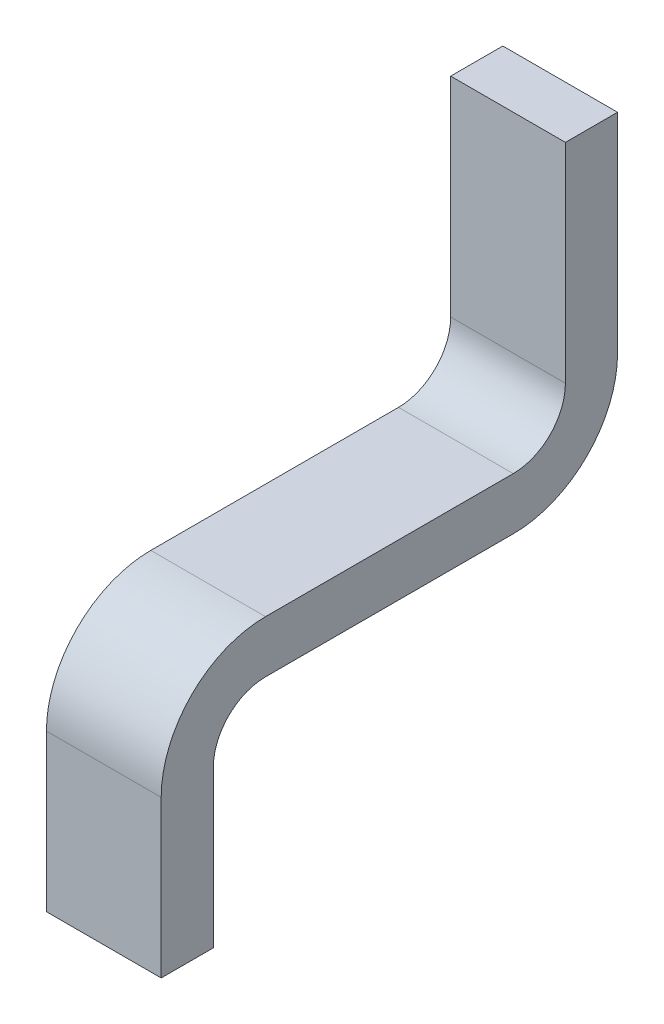
ISO-10303-21;
HEADER;
FILE_DESCRIPTION(('STEP AP214'),'2;1');
FILE_NAME('part.step','',(''),(''),'','','');
FILE_SCHEMA(('AUTOMOTIVE_DESIGN { 1 0 10303 214 1 1 1 1 }'));
ENDSEC;
DATA;
#1=APPLICATION_CONTEXT('core data for automotive mechanical design processes');
#2=APPLICATION_PROTOCOL_DEFINITION('international standard','automotive_design',2000,#1);
#3=PRODUCT_CONTEXT('',#1,'mechanical');
#4=PRODUCT('Part','Part','',(#3));
#5=PRODUCT_RELATED_PRODUCT_CATEGORY('part','',(#4));
#6=PRODUCT_DEFINITION_FORMATION('','',#4);
#7=PRODUCT_DEFINITION_CONTEXT('part definition',#1,'design');
#8=PRODUCT_DEFINITION('design','',#6,#7);
#9=PRODUCT_DEFINITION_SHAPE('','',#8);
#10=(LENGTH_UNIT() NAMED_UNIT(*) SI_UNIT(.MILLI.,.METRE.));
#11=(NAMED_UNIT(*) PLANE_ANGLE_UNIT() SI_UNIT($,.RADIAN.));
#12=(NAMED_UNIT(*) SI_UNIT($,.STERADIAN.) SOLID_ANGLE_UNIT());
#13=UNCERTAINTY_MEASURE_WITH_UNIT(LENGTH_MEASURE(1.E-05),#10,'distance_accuracy_value','');
#14=(GEOMETRIC_REPRESENTATION_CONTEXT(3) GLOBAL_UNCERTAINTY_ASSIGNED_CONTEXT((#13)) GLOBAL_UNIT_ASSIGNED_CONTEXT((#10,
#11,#12)) REPRESENTATION_CONTEXT('',''));
#15=CARTESIAN_POINT('',(0.,0.,0.));
#16=DIRECTION('',(0.,0.,1.));
#17=DIRECTION('',(1.,0.,0.));
#18=AXIS2_PLACEMENT_3D('',#15,#16,#17);
#19=CARTESIAN_POINT('',(-0.36,3.9,0.675));
#20=DIRECTION('',(1.,0.,0.));
#21=DIRECTION('',(0.,1.,0.));
#22=AXIS2_PLACEMENT_3D('',#19,#20,#21);
#23=PLANE('',#22);
#24=CARTESIAN_POINT('',(-0.36,3.8,0.675));
#25=DIRECTION('',(1.,0.,0.));
#26=DIRECTION('',(0.,1.,0.));
#27=AXIS2_PLACEMENT_3D('',#24,#25,#26);
#28=CIRCLE('',#27,0.1);
#29=CARTESIAN_POINT('',(-0.36,3.9,0.675));
#30=VERTEX_POINT('',#29);
#31=CARTESIAN_POINT('',(-0.36,3.8,0.775));
#32=VERTEX_POINT('',#31);
#33=EDGE_CURVE('E162',#30,#32,#28,.T.);
#34=ORIENTED_EDGE('',*,*,#33,.T.);
#35=DIRECTION('',(0.,1.,0.));
#36=VECTOR('',#35,1.);
#37=CARTESIAN_POINT('',(-0.36,3.5,0.775));
#38=LINE('',#37,#36);
#39=CARTESIAN_POINT('',(-0.36,3.5,0.775));
#40=VERTEX_POINT('',#39);
#41=EDGE_CURVE('E120',#32,#40,#38,.F.);
#42=ORIENTED_EDGE('',*,*,#41,.T.);
#43=DIRECTION('',(0.,0.,1.));
#44=VECTOR('',#43,1.);
#45=CARTESIAN_POINT('',(-0.36,3.5,0.775));
#46=LINE('',#45,#44);
#47=CARTESIAN_POINT('',(-0.36,3.5,0.875));
#48=VERTEX_POINT('',#47);
#49=EDGE_CURVE('E116',#48,#40,#46,.F.);
#50=ORIENTED_EDGE('',*,*,#49,.F.);
#51=DIRECTION('',(0.,1.,0.));
#52=VECTOR('',#51,1.);
#53=CARTESIAN_POINT('',(-0.36,3.5,0.875));
#54=LINE('',#53,#52);
#55=CARTESIAN_POINT('',(-0.36,3.8,0.875));
#56=VERTEX_POINT('',#55);
#57=EDGE_CURVE('E111',#48,#56,#54,.T.);
#58=ORIENTED_EDGE('',*,*,#57,.T.);
#59=CARTESIAN_POINT('',(-0.36,3.8,0.675));
#60=DIRECTION('',(1.,0.,0.));
#61=DIRECTION('',(0.,1.,0.));
#62=AXIS2_PLACEMENT_3D('',#59,#60,#61);
#63=CIRCLE('',#62,0.2);
#64=CARTESIAN_POINT('',(-0.36,4.,0.675));
#65=VERTEX_POINT('',#64);
#66=EDGE_CURVE('E102',#65,#56,#63,.T.);
#67=ORIENTED_EDGE('',*,*,#66,.F.);
#68=DIRECTION('',(0.,0.,1.));
#69=VECTOR('',#68,1.);
#70=CARTESIAN_POINT('',(-0.36,4.,0.675));
#71=LINE('',#70,#69);
#72=CARTESIAN_POINT('',(-0.36,4.,0.2));
#73=VERTEX_POINT('',#72);
#74=EDGE_CURVE('E98',#65,#73,#71,.F.);
#75=ORIENTED_EDGE('',*,*,#74,.T.);
#76=CARTESIAN_POINT('',(-0.36,4.1,0.2));
#77=DIRECTION('',(-1.,0.,0.));
#78=DIRECTION('',(0.,-1.,0.));
#79=AXIS2_PLACEMENT_3D('',#76,#77,#78);
#80=CIRCLE('',#79,0.1);
#81=CARTESIAN_POINT('',(-0.36,4.1,0.1));
#82=VERTEX_POINT('',#81);
#83=EDGE_CURVE('E20',#73,#82,#80,.F.);
#84=ORIENTED_EDGE('',*,*,#83,.T.);
#85=DIRECTION('',(0.,1.,0.));
#86=VECTOR('',#85,1.);
#87=CARTESIAN_POINT('',(-0.36,4.1,0.1));
#88=LINE('',#87,#86);
#89=CARTESIAN_POINT('',(-0.36,4.5,0.1));
#90=VERTEX_POINT('',#89);
#91=EDGE_CURVE('E145',#82,#90,#88,.T.);
#92=ORIENTED_EDGE('',*,*,#91,.T.);
#93=DIRECTION('',(0.,0.,1.));
#94=VECTOR('',#93,1.);
#95=CARTESIAN_POINT('',(-0.36,4.5,0.));
#96=LINE('',#95,#94);
#97=CARTESIAN_POINT('',(-0.36,4.5,0.));
#98=VERTEX_POINT('',#97);
#99=EDGE_CURVE('E139',#90,#98,#96,.F.);
#100=ORIENTED_EDGE('',*,*,#99,.T.);
#101=DIRECTION('',(0.,1.,0.));
#102=VECTOR('',#101,1.);
#103=CARTESIAN_POINT('',(-0.36,4.1,0.));
#104=LINE('',#103,#102);
#105=CARTESIAN_POINT('',(-0.36,4.1,0.));
#106=VERTEX_POINT('',#105);
#107=EDGE_CURVE('E132',#98,#106,#104,.F.);
#108=ORIENTED_EDGE('',*,*,#107,.T.);
#109=CARTESIAN_POINT('',(-0.36,4.1,0.2));
#110=DIRECTION('',(-1.,0.,0.));
#111=DIRECTION('',(0.,-1.,0.));
#112=AXIS2_PLACEMENT_3D('',#109,#110,#111);
#113=CIRCLE('',#112,0.2);
#114=CARTESIAN_POINT('',(-0.36,3.9,0.2));
#115=VERTEX_POINT('',#114);
#116=EDGE_CURVE('E135',#115,#106,#113,.F.);
#117=ORIENTED_EDGE('',*,*,#116,.F.);
#118=DIRECTION('',(0.,0.,1.));
#119=VECTOR('',#118,1.);
#120=CARTESIAN_POINT('',(-0.36,3.9,0.675));
#121=LINE('',#120,#119);
#122=EDGE_CURVE('E128',#115,#30,#121,.T.);
#123=ORIENTED_EDGE('',*,*,#122,.T.);
#124=EDGE_LOOP('',(#34,#42,#50,#58,#67,#75,#84,#92,#100,#108,#117,#123));
#125=FACE_BOUND('',#124,.T.);
#126=ADVANCED_FACE('F17',(#125),#23,.F.);
#127=CARTESIAN_POINT('',(-0.36,4.1,0.2));
#128=DIRECTION('',(-1.,0.,0.));
#129=DIRECTION('',(0.,-1.,0.));
#130=AXIS2_PLACEMENT_3D('',#127,#128,#129);
#131=CYLINDRICAL_SURFACE('',#130,0.1);
#132=DIRECTION('',(1.,0.,0.));
#133=VECTOR('',#132,1.);
#134=CARTESIAN_POINT('',(-0.36,4.,0.2));
#135=LINE('',#134,#133);
#136=CARTESIAN_POINT('',(-0.14,4.,0.2));
#137=VERTEX_POINT('',#136);
#138=EDGE_CURVE('E91',#73,#137,#135,.T.);
#139=ORIENTED_EDGE('',*,*,#138,.T.);
#140=CARTESIAN_POINT('',(-0.14,4.1,0.2));
#141=DIRECTION('',(-1.,0.,0.));
#142=DIRECTION('',(0.,-1.,0.));
#143=AXIS2_PLACEMENT_3D('',#140,#141,#142);
#144=CIRCLE('',#143,0.1);
#145=CARTESIAN_POINT('',(-0.14,4.1,0.1));
#146=VERTEX_POINT('',#145);
#147=EDGE_CURVE('E103',#137,#146,#144,.F.);
#148=ORIENTED_EDGE('',*,*,#147,.T.);
#149=DIRECTION('',(-1.,0.,0.));
#150=VECTOR('',#149,1.);
#151=CARTESIAN_POINT('',(-0.36,4.1,0.1));
#152=LINE('',#151,#150);
#153=EDGE_CURVE('E92',#146,#82,#152,.T.);
#154=ORIENTED_EDGE('',*,*,#153,.T.);
#155=ORIENTED_EDGE('',*,*,#83,.F.);
#156=EDGE_LOOP('',(#139,#148,#154,#155));
#157=FACE_BOUND('',#156,.T.);
#158=ADVANCED_FACE('F89',(#157),#131,.F.);
#159=CARTESIAN_POINT('',(-0.36,4.1,0.1));
#160=DIRECTION('',(0.,0.,-1.));
#161=DIRECTION('',(-1.,0.,0.));
#162=AXIS2_PLACEMENT_3D('',#159,#160,#161);
#163=PLANE('',#162);
#164=ORIENTED_EDGE('',*,*,#153,.F.);
#165=DIRECTION('',(0.,-1.,0.));
#166=VECTOR('',#165,1.);
#167=CARTESIAN_POINT('',(-0.14,4.,0.1));
#168=LINE('',#167,#166);
#169=CARTESIAN_POINT('',(-0.14,4.5,0.1));
#170=VERTEX_POINT('',#169);
#171=EDGE_CURVE('E105',#146,#170,#168,.F.);
#172=ORIENTED_EDGE('',*,*,#171,.T.);
#173=DIRECTION('',(1.,0.,0.));
#174=VECTOR('',#173,1.);
#175=CARTESIAN_POINT('',(-0.14,4.5,0.1));
#176=LINE('',#175,#174);
#177=EDGE_CURVE('E142',#170,#90,#176,.F.);
#178=ORIENTED_EDGE('',*,*,#177,.T.);
#179=ORIENTED_EDGE('',*,*,#91,.F.);
#180=EDGE_LOOP('',(#164,#172,#178,#179));
#181=FACE_BOUND('',#180,.T.);
#182=ADVANCED_FACE('F187',(#181),#163,.F.);
#183=CARTESIAN_POINT('',(-0.14,4.5,0.));
#184=DIRECTION('',(0.,-1.,0.));
#185=DIRECTION('',(1.,0.,0.));
#186=AXIS2_PLACEMENT_3D('',#183,#184,#185);
#187=PLANE('',#186);
#188=ORIENTED_EDGE('',*,*,#177,.F.);
#189=DIRECTION('',(0.,0.,1.));
#190=VECTOR('',#189,1.);
#191=CARTESIAN_POINT('',(-0.14,4.5,0.675));
#192=LINE('',#191,#190);
#193=CARTESIAN_POINT('',(-0.14,4.5,0.));
#194=VERTEX_POINT('',#193);
#195=EDGE_CURVE('E176',#170,#194,#192,.F.);
#196=ORIENTED_EDGE('',*,*,#195,.T.);
#197=DIRECTION('',(1.,0.,0.));
#198=VECTOR('',#197,1.);
#199=CARTESIAN_POINT('',(-0.14,4.5,0.));
#200=LINE('',#199,#198);
#201=EDGE_CURVE('E136',#194,#98,#200,.F.);
#202=ORIENTED_EDGE('',*,*,#201,.T.);
#203=ORIENTED_EDGE('',*,*,#99,.F.);
#204=EDGE_LOOP('',(#188,#196,#202,#203));
#205=FACE_BOUND('',#204,.T.);
#206=ADVANCED_FACE('F192',(#205),#187,.F.);
#207=CARTESIAN_POINT('',(-0.14,4.1,0.));
#208=DIRECTION('',(0.,0.,1.));
#209=DIRECTION('',(1.,0.,0.));
#210=AXIS2_PLACEMENT_3D('',#207,#208,#209);
#211=PLANE('',#210);
#212=DIRECTION('',(-1.,0.,0.));
#213=VECTOR('',#212,1.);
#214=CARTESIAN_POINT('',(-0.14,4.1,0.));
#215=LINE('',#214,#213);
#216=CARTESIAN_POINT('',(-0.14,4.1,0.));
#217=VERTEX_POINT('',#216);
#218=EDGE_CURVE('E163',#106,#217,#215,.F.);
#219=ORIENTED_EDGE('',*,*,#218,.F.);
#220=ORIENTED_EDGE('',*,*,#107,.F.);
#221=ORIENTED_EDGE('',*,*,#201,.F.);
#222=DIRECTION('',(0.,-1.,0.));
#223=VECTOR('',#222,1.);
#224=CARTESIAN_POINT('',(-0.14,4.,0.));
#225=LINE('',#224,#223);
#226=EDGE_CURVE('E159',#194,#217,#225,.T.);
#227=ORIENTED_EDGE('',*,*,#226,.T.);
#228=EDGE_LOOP('',(#219,#220,#221,#227));
#229=FACE_BOUND('',#228,.T.);
#230=ADVANCED_FACE('F264',(#229),#211,.F.);
#231=CARTESIAN_POINT('',(-0.14,4.1,0.2));
#232=DIRECTION('',(-1.,0.,0.));
#233=DIRECTION('',(0.,-1.,0.));
#234=AXIS2_PLACEMENT_3D('',#231,#232,#233);
#235=CYLINDRICAL_SURFACE('',#234,0.2);
#236=ORIENTED_EDGE('',*,*,#116,.T.);
#237=ORIENTED_EDGE('',*,*,#218,.T.);
#238=CARTESIAN_POINT('',(-0.14,4.1,0.2));
#239=DIRECTION('',(-1.,0.,0.));
#240=DIRECTION('',(0.,-1.,0.));
#241=AXIS2_PLACEMENT_3D('',#238,#239,#240);
#242=CIRCLE('',#241,0.2);
#243=CARTESIAN_POINT('',(-0.14,3.9,0.2));
#244=VERTEX_POINT('',#243);
#245=EDGE_CURVE('E157',#217,#244,#242,.T.);
#246=ORIENTED_EDGE('',*,*,#245,.T.);
#247=DIRECTION('',(-1.,0.,0.));
#248=VECTOR('',#247,1.);
#249=CARTESIAN_POINT('',(-0.14,3.9,0.2));
#250=LINE('',#249,#248);
#251=EDGE_CURVE('E131',#244,#115,#250,.T.);
#252=ORIENTED_EDGE('',*,*,#251,.T.);
#253=EDGE_LOOP('',(#236,#237,#246,#252));
#254=FACE_BOUND('',#253,.T.);
#255=ADVANCED_FACE('F266',(#254),#235,.T.);
#256=CARTESIAN_POINT('',(-0.14,3.9,0.675));
#257=DIRECTION('',(0.,1.,0.));
#258=DIRECTION('',(-1.,0.,0.));
#259=AXIS2_PLACEMENT_3D('',#256,#257,#258);
#260=PLANE('',#259);
#261=DIRECTION('',(1.,0.,0.));
#262=VECTOR('',#261,1.);
#263=CARTESIAN_POINT('',(-0.14,3.9,0.675));
#264=LINE('',#263,#262);
#265=CARTESIAN_POINT('',(-0.14,3.9,0.675));
#266=VERTEX_POINT('',#265);
#267=EDGE_CURVE('E130',#266,#30,#264,.F.);
#268=ORIENTED_EDGE('',*,*,#267,.T.);
#269=ORIENTED_EDGE('',*,*,#122,.F.);
#270=ORIENTED_EDGE('',*,*,#251,.F.);
#271=DIRECTION('',(0.,0.,1.));
#272=VECTOR('',#271,1.);
#273=CARTESIAN_POINT('',(-0.14,3.9,0.675));
#274=LINE('',#273,#272);
#275=EDGE_CURVE('E156',#244,#266,#274,.T.);
#276=ORIENTED_EDGE('',*,*,#275,.T.);
#277=EDGE_LOOP('',(#268,#269,#270,#276));
#278=FACE_BOUND('',#277,.T.);
#279=ADVANCED_FACE('F231',(#278),#260,.F.);
#280=CARTESIAN_POINT('',(-0.14,3.8,0.675));
#281=DIRECTION('',(1.,0.,0.));
#282=DIRECTION('',(0.,1.,0.));
#283=AXIS2_PLACEMENT_3D('',#280,#281,#282);
#284=CYLINDRICAL_SURFACE('',#283,0.1);
#285=DIRECTION('',(1.,0.,0.));
#286=VECTOR('',#285,1.);
#287=CARTESIAN_POINT('',(-0.14,3.8,0.775));
#288=LINE('',#287,#286);
#289=CARTESIAN_POINT('',(-0.14,3.8,0.775));
#290=VERTEX_POINT('',#289);
#291=EDGE_CURVE('E125',#290,#32,#288,.F.);
#292=ORIENTED_EDGE('',*,*,#291,.T.);
#293=ORIENTED_EDGE('',*,*,#33,.F.);
#294=ORIENTED_EDGE('',*,*,#267,.F.);
#295=CARTESIAN_POINT('',(-0.14,3.8,0.675));
#296=DIRECTION('',(1.,0.,0.));
#297=DIRECTION('',(0.,1.,0.));
#298=AXIS2_PLACEMENT_3D('',#295,#296,#297);
#299=CIRCLE('',#298,0.1);
#300=EDGE_CURVE('E152',#266,#290,#299,.T.);
#301=ORIENTED_EDGE('',*,*,#300,.T.);
#302=EDGE_LOOP('',(#292,#293,#294,#301));
#303=FACE_BOUND('',#302,.T.);
#304=ADVANCED_FACE('F235',(#303),#284,.F.);
#305=CARTESIAN_POINT('',(-0.14,3.5,0.775));
#306=DIRECTION('',(0.,0.,1.));
#307=DIRECTION('',(1.,0.,0.));
#308=AXIS2_PLACEMENT_3D('',#305,#306,#307);
#309=PLANE('',#308);
#310=DIRECTION('',(1.,0.,0.));
#311=VECTOR('',#310,1.);
#312=CARTESIAN_POINT('',(-0.14,3.5,0.775));
#313=LINE('',#312,#311);
#314=CARTESIAN_POINT('',(-0.14,3.5,0.775));
#315=VERTEX_POINT('',#314);
#316=EDGE_CURVE('E119',#40,#315,#313,.T.);
#317=ORIENTED_EDGE('',*,*,#316,.F.);
#318=ORIENTED_EDGE('',*,*,#41,.F.);
#319=ORIENTED_EDGE('',*,*,#291,.F.);
#320=DIRECTION('',(0.,-1.,0.));
#321=VECTOR('',#320,1.);
#322=CARTESIAN_POINT('',(-0.14,4.,0.775));
#323=LINE('',#322,#321);
#324=EDGE_CURVE('E155',#290,#315,#323,.T.);
#325=ORIENTED_EDGE('',*,*,#324,.T.);
#326=EDGE_LOOP('',(#317,#318,#319,#325));
#327=FACE_BOUND('',#326,.T.);
#328=ADVANCED_FACE('F259',(#327),#309,.F.);
#329=CARTESIAN_POINT('',(-0.14,3.5,0.775));
#330=DIRECTION('',(0.,-1.,0.));
#331=DIRECTION('',(1.,0.,0.));
#332=AXIS2_PLACEMENT_3D('',#329,#330,#331);
#333=PLANE('',#332);
#334=DIRECTION('',(0.,0.,1.));
#335=VECTOR('',#334,1.);
#336=CARTESIAN_POINT('',(-0.14,3.5,0.675));
#337=LINE('',#336,#335);
#338=CARTESIAN_POINT('',(-0.14,3.5,0.875));
#339=VERTEX_POINT('',#338);
#340=EDGE_CURVE('E217',#315,#339,#337,.T.);
#341=ORIENTED_EDGE('',*,*,#340,.T.);
#342=DIRECTION('',(-1.,0.,0.));
#343=VECTOR('',#342,1.);
#344=CARTESIAN_POINT('',(-0.36,3.5,0.875));
#345=LINE('',#344,#343);
#346=EDGE_CURVE('E113',#339,#48,#345,.T.);
#347=ORIENTED_EDGE('',*,*,#346,.T.);
#348=ORIENTED_EDGE('',*,*,#49,.T.);
#349=ORIENTED_EDGE('',*,*,#316,.T.);
#350=EDGE_LOOP('',(#341,#347,#348,#349));
#351=FACE_BOUND('',#350,.T.);
#352=ADVANCED_FACE('F255',(#351),#333,.T.);
#353=CARTESIAN_POINT('',(-0.36,3.5,0.875));
#354=DIRECTION('',(0.,0.,-1.));
#355=DIRECTION('',(-1.,0.,0.));
#356=AXIS2_PLACEMENT_3D('',#353,#354,#355);
#357=PLANE('',#356);
#358=ORIENTED_EDGE('',*,*,#346,.F.);
#359=DIRECTION('',(0.,-1.,0.));
#360=VECTOR('',#359,1.);
#361=CARTESIAN_POINT('',(-0.14,4.,0.875));
#362=LINE('',#361,#360);
#363=CARTESIAN_POINT('',(-0.14,3.8,0.875));
#364=VERTEX_POINT('',#363);
#365=EDGE_CURVE('E151',#339,#364,#362,.F.);
#366=ORIENTED_EDGE('',*,*,#365,.T.);
#367=DIRECTION('',(1.,0.,0.));
#368=VECTOR('',#367,1.);
#369=CARTESIAN_POINT('',(-0.36,3.8,0.875));
#370=LINE('',#369,#368);
#371=EDGE_CURVE('E99',#56,#364,#370,.T.);
#372=ORIENTED_EDGE('',*,*,#371,.F.);
#373=ORIENTED_EDGE('',*,*,#57,.F.);
#374=EDGE_LOOP('',(#358,#366,#372,#373));
#375=FACE_BOUND('',#374,.T.);
#376=ADVANCED_FACE('F251',(#375),#357,.F.);
#377=CARTESIAN_POINT('',(-0.36,3.8,0.675));
#378=DIRECTION('',(1.,0.,0.));
#379=DIRECTION('',(0.,1.,0.));
#380=AXIS2_PLACEMENT_3D('',#377,#378,#379);
#381=CYLINDRICAL_SURFACE('',#380,0.2);
#382=CARTESIAN_POINT('',(-0.14,3.8,0.675));
#383=DIRECTION('',(1.,0.,0.));
#384=DIRECTION('',(0.,1.,0.));
#385=AXIS2_PLACEMENT_3D('',#382,#383,#384);
#386=CIRCLE('',#385,0.2);
#387=CARTESIAN_POINT('',(-0.14,4.,0.675));
#388=VERTEX_POINT('',#387);
#389=EDGE_CURVE('E26',#364,#388,#386,.F.);
#390=ORIENTED_EDGE('',*,*,#389,.T.);
#391=DIRECTION('',(1.,0.,0.));
#392=VECTOR('',#391,1.);
#393=CARTESIAN_POINT('',(-0.36,4.,0.675));
#394=LINE('',#393,#392);
#395=EDGE_CURVE('E34',#388,#65,#394,.F.);
#396=ORIENTED_EDGE('',*,*,#395,.T.);
#397=ORIENTED_EDGE('',*,*,#66,.T.);
#398=ORIENTED_EDGE('',*,*,#371,.T.);
#399=EDGE_LOOP('',(#390,#396,#397,#398));
#400=FACE_BOUND('',#399,.T.);
#401=ADVANCED_FACE('F280',(#400),#381,.T.);
#402=CARTESIAN_POINT('',(-0.36,4.,0.675));
#403=DIRECTION('',(0.,-1.,0.));
#404=DIRECTION('',(1.,0.,0.));
#405=AXIS2_PLACEMENT_3D('',#402,#403,#404);
#406=PLANE('',#405);
#407=ORIENTED_EDGE('',*,*,#395,.F.);
#408=DIRECTION('',(0.,0.,1.));
#409=VECTOR('',#408,1.);
#410=CARTESIAN_POINT('',(-0.14,4.,0.675));
#411=LINE('',#410,#409);
#412=EDGE_CURVE('E11',#388,#137,#411,.F.);
#413=ORIENTED_EDGE('',*,*,#412,.T.);
#414=ORIENTED_EDGE('',*,*,#138,.F.);
#415=ORIENTED_EDGE('',*,*,#74,.F.);
#416=EDGE_LOOP('',(#407,#413,#414,#415));
#417=FACE_BOUND('',#416,.T.);
#418=ADVANCED_FACE('F97',(#417),#406,.F.);
#419=CARTESIAN_POINT('',(-0.14,4.,0.675));
#420=DIRECTION('',(-1.,0.,0.));
#421=DIRECTION('',(0.,-1.,0.));
#422=AXIS2_PLACEMENT_3D('',#419,#420,#421);
#423=PLANE('',#422);
#424=ORIENTED_EDGE('',*,*,#389,.F.);
#425=ORIENTED_EDGE('',*,*,#365,.F.);
#426=ORIENTED_EDGE('',*,*,#340,.F.);
#427=ORIENTED_EDGE('',*,*,#324,.F.);
#428=ORIENTED_EDGE('',*,*,#300,.F.);
#429=ORIENTED_EDGE('',*,*,#275,.F.);
#430=ORIENTED_EDGE('',*,*,#245,.F.);
#431=ORIENTED_EDGE('',*,*,#226,.F.);
#432=ORIENTED_EDGE('',*,*,#195,.F.);
#433=ORIENTED_EDGE('',*,*,#171,.F.);
#434=ORIENTED_EDGE('',*,*,#147,.F.);
#435=ORIENTED_EDGE('',*,*,#412,.F.);
#436=EDGE_LOOP('',(#424,#425,#426,#427,#428,#429,#430,#431,#432,#433,#434,#435));
#437=FACE_BOUND('',#436,.T.);
#438=ADVANCED_FACE('F197',(#437),#423,.F.);
#439=CLOSED_SHELL('',(#126,#158,#182,#206,#230,#255,#279,#304,#328,#352,#376,#401,#418,#438));
#440=MANIFOLD_SOLID_BREP('B1',#439);
#441=ADVANCED_BREP_SHAPE_REPRESENTATION('',(#18,#440),#14);
#442=SHAPE_DEFINITION_REPRESENTATION(#9,#441);
ENDSEC;
END-ISO-10303-21;
